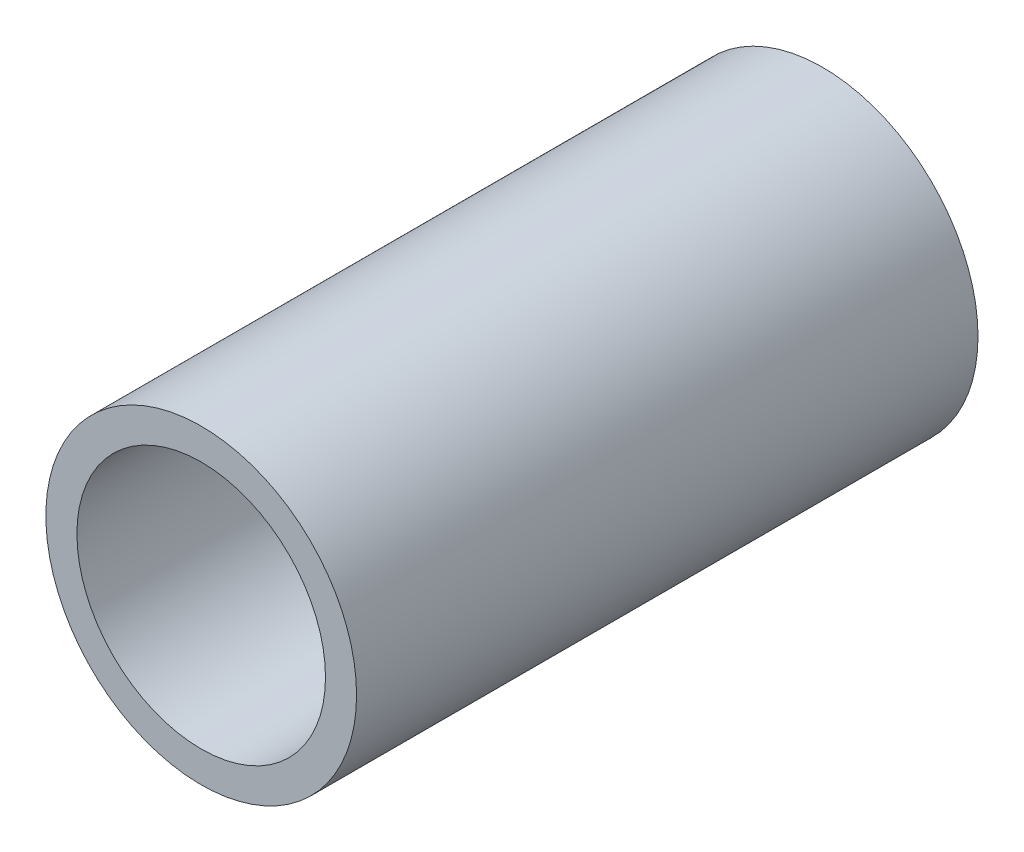
ISO-10303-21;
HEADER;
FILE_DESCRIPTION(('STEP AP214'),'2;1');
FILE_NAME('part.step','',(''),(''),'','','');
FILE_SCHEMA(('AUTOMOTIVE_DESIGN { 1 0 10303 214 1 1 1 1 }'));
ENDSEC;
DATA;
#1=APPLICATION_CONTEXT('core data for automotive mechanical design processes');
#2=APPLICATION_PROTOCOL_DEFINITION('international standard','automotive_design',2000,#1);
#3=PRODUCT_CONTEXT('',#1,'mechanical');
#4=PRODUCT('Part','Part','',(#3));
#5=PRODUCT_RELATED_PRODUCT_CATEGORY('part','',(#4));
#6=PRODUCT_DEFINITION_FORMATION('','',#4);
#7=PRODUCT_DEFINITION_CONTEXT('part definition',#1,'design');
#8=PRODUCT_DEFINITION('design','',#6,#7);
#9=PRODUCT_DEFINITION_SHAPE('','',#8);
#10=(LENGTH_UNIT() NAMED_UNIT(*) SI_UNIT(.MILLI.,.METRE.));
#11=(NAMED_UNIT(*) PLANE_ANGLE_UNIT() SI_UNIT($,.RADIAN.));
#12=(NAMED_UNIT(*) SI_UNIT($,.STERADIAN.) SOLID_ANGLE_UNIT());
#13=UNCERTAINTY_MEASURE_WITH_UNIT(LENGTH_MEASURE(1.E-05),#10,'distance_accuracy_value','');
#14=(GEOMETRIC_REPRESENTATION_CONTEXT(3) GLOBAL_UNCERTAINTY_ASSIGNED_CONTEXT((#13)) GLOBAL_UNIT_ASSIGNED_CONTEXT((#10,
#11,#12)) REPRESENTATION_CONTEXT('',''));
#15=CARTESIAN_POINT('',(0.,0.,0.));
#16=DIRECTION('',(0.,0.,1.));
#17=DIRECTION('',(1.,0.,0.));
#18=AXIS2_PLACEMENT_3D('',#15,#16,#17);
#19=CARTESIAN_POINT('',(0.,0.,5.));
#20=DIRECTION('',(0.,0.,1.));
#21=DIRECTION('',(1.,0.,0.));
#22=AXIS2_PLACEMENT_3D('',#19,#20,#21);
#23=PLANE('',#22);
#24=CARTESIAN_POINT('',(0.,0.,5.));
#25=DIRECTION('',(0.,0.,1.));
#26=DIRECTION('',(1.,0.,0.));
#27=AXIS2_PLACEMENT_3D('',#24,#25,#26);
#28=CIRCLE('',#27,1.25);
#29=CARTESIAN_POINT('',(1.25,0.,5.));
#30=VERTEX_POINT('',#29);
#31=EDGE_CURVE('E10',#30,#30,#28,.T.);
#32=ORIENTED_EDGE('',*,*,#31,.T.);
#33=EDGE_LOOP('',(#32));
#34=FACE_BOUND('',#33,.T.);
#35=CARTESIAN_POINT('',(0.,0.,5.));
#36=DIRECTION('',(0.,0.,1.));
#37=DIRECTION('',(1.,0.,0.));
#38=AXIS2_PLACEMENT_3D('',#35,#36,#37);
#39=CIRCLE('',#38,0.999999999999999);
#40=CARTESIAN_POINT('',(0.999999999999999,0.,5.));
#41=VERTEX_POINT('',#40);
#42=EDGE_CURVE('E42',#41,#41,#39,.T.);
#43=ORIENTED_EDGE('',*,*,#42,.F.);
#44=EDGE_LOOP('',(#43));
#45=FACE_BOUND('',#44,.T.);
#46=ADVANCED_FACE('F31',(#34,#45),#23,.T.);
#47=CARTESIAN_POINT('',(0.,0.,0.));
#48=DIRECTION('',(0.,0.,1.));
#49=DIRECTION('',(1.,0.,0.));
#50=AXIS2_PLACEMENT_3D('',#47,#48,#49);
#51=PLANE('',#50);
#52=CARTESIAN_POINT('',(0.,0.,0.));
#53=DIRECTION('',(0.,0.,1.));
#54=DIRECTION('',(1.,0.,0.));
#55=AXIS2_PLACEMENT_3D('',#52,#53,#54);
#56=CIRCLE('',#55,1.25);
#57=CARTESIAN_POINT('',(1.25,0.,0.));
#58=VERTEX_POINT('',#57);
#59=EDGE_CURVE('E35',#58,#58,#56,.T.);
#60=ORIENTED_EDGE('',*,*,#59,.F.);
#61=EDGE_LOOP('',(#60));
#62=FACE_BOUND('',#61,.T.);
#63=CARTESIAN_POINT('',(0.,0.,0.));
#64=DIRECTION('',(0.,0.,1.));
#65=DIRECTION('',(1.,0.,0.));
#66=AXIS2_PLACEMENT_3D('',#63,#64,#65);
#67=CIRCLE('',#66,0.999999999999999);
#68=CARTESIAN_POINT('',(0.999999999999999,0.,0.));
#69=VERTEX_POINT('',#68);
#70=EDGE_CURVE('E44',#69,#69,#67,.T.);
#71=ORIENTED_EDGE('',*,*,#70,.T.);
#72=EDGE_LOOP('',(#71));
#73=FACE_BOUND('',#72,.T.);
#74=ADVANCED_FACE('F54',(#62,#73),#51,.F.);
#75=CARTESIAN_POINT('',(0.,0.,5.));
#76=DIRECTION('',(0.,0.,-1.));
#77=DIRECTION('',(-1.,0.,0.));
#78=AXIS2_PLACEMENT_3D('',#75,#76,#77);
#79=CYLINDRICAL_SURFACE('',#78,1.25);
#80=ORIENTED_EDGE('',*,*,#31,.F.);
#81=EDGE_LOOP('',(#80));
#82=FACE_BOUND('',#81,.T.);
#83=ORIENTED_EDGE('',*,*,#59,.T.);
#84=EDGE_LOOP('',(#83));
#85=FACE_BOUND('',#84,.T.);
#86=ADVANCED_FACE('F33',(#82,#85),#79,.T.);
#87=CARTESIAN_POINT('',(0.,0.,5.));
#88=DIRECTION('',(0.,0.,-1.));
#89=DIRECTION('',(-1.,0.,0.));
#90=AXIS2_PLACEMENT_3D('',#87,#88,#89);
#91=CYLINDRICAL_SURFACE('',#90,0.999999999999999);
#92=ORIENTED_EDGE('',*,*,#42,.T.);
#93=EDGE_LOOP('',(#92));
#94=FACE_BOUND('',#93,.T.);
#95=ORIENTED_EDGE('',*,*,#70,.F.);
#96=EDGE_LOOP('',(#95));
#97=FACE_BOUND('',#96,.T.);
#98=ADVANCED_FACE('F50',(#94,#97),#91,.F.);
#99=CLOSED_SHELL('',(#46,#74,#86,#98));
#100=MANIFOLD_SOLID_BREP('B2',#99);
#101=ADVANCED_BREP_SHAPE_REPRESENTATION('',(#18,#100),#14);
#102=SHAPE_DEFINITION_REPRESENTATION(#9,#101);
ENDSEC;
END-ISO-10303-21;
